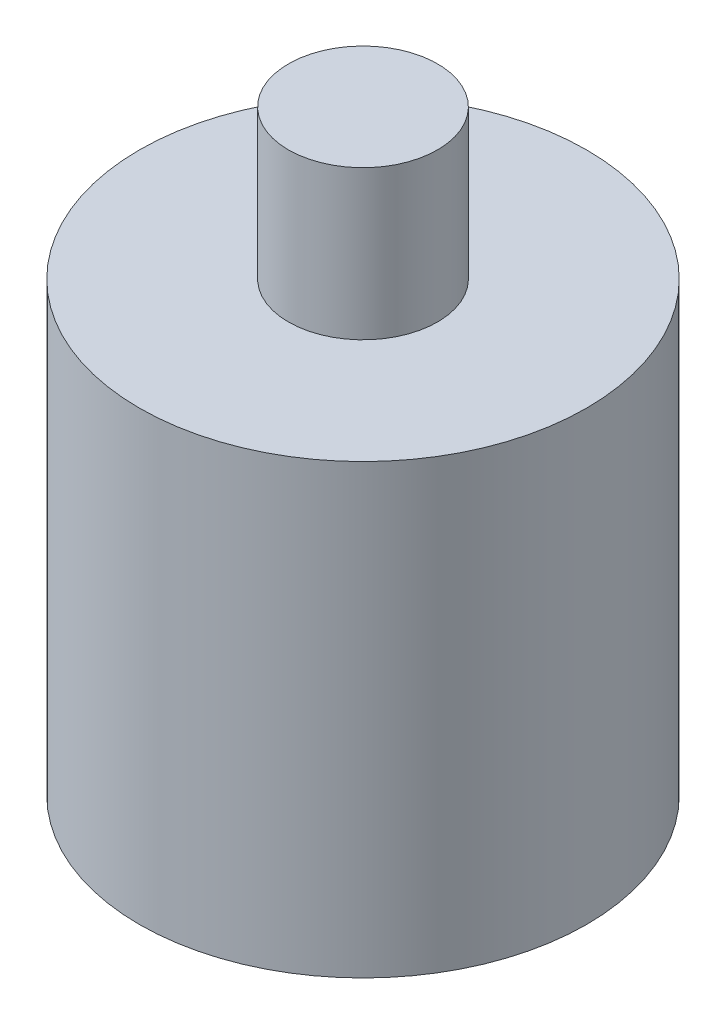
ISO-10303-21;
HEADER;
FILE_DESCRIPTION(('STEP AP214'),'2;1');
FILE_NAME('part.step','',(''),(''),'','','');
FILE_SCHEMA(('AUTOMOTIVE_DESIGN { 1 0 10303 214 1 1 1 1 }'));
ENDSEC;
DATA;
#1=APPLICATION_CONTEXT('core data for automotive mechanical design processes');
#2=APPLICATION_PROTOCOL_DEFINITION('international standard','automotive_design',2000,#1);
#3=PRODUCT_CONTEXT('',#1,'mechanical');
#4=PRODUCT('Part','Part','',(#3));
#5=PRODUCT_RELATED_PRODUCT_CATEGORY('part','',(#4));
#6=PRODUCT_DEFINITION_FORMATION('','',#4);
#7=PRODUCT_DEFINITION_CONTEXT('part definition',#1,'design');
#8=PRODUCT_DEFINITION('design','',#6,#7);
#9=PRODUCT_DEFINITION_SHAPE('','',#8);
#10=(LENGTH_UNIT() NAMED_UNIT(*) SI_UNIT(.MILLI.,.METRE.));
#11=(NAMED_UNIT(*) PLANE_ANGLE_UNIT() SI_UNIT($,.RADIAN.));
#12=(NAMED_UNIT(*) SI_UNIT($,.STERADIAN.) SOLID_ANGLE_UNIT());
#13=UNCERTAINTY_MEASURE_WITH_UNIT(LENGTH_MEASURE(1.E-05),#10,'distance_accuracy_value','');
#14=(GEOMETRIC_REPRESENTATION_CONTEXT(3) GLOBAL_UNCERTAINTY_ASSIGNED_CONTEXT((#13)) GLOBAL_UNIT_ASSIGNED_CONTEXT((#10,
#11,#12)) REPRESENTATION_CONTEXT('',''));
#15=CARTESIAN_POINT('',(0.,0.,0.));
#16=DIRECTION('',(0.,0.,1.));
#17=DIRECTION('',(1.,0.,0.));
#18=AXIS2_PLACEMENT_3D('',#15,#16,#17);
#19=CARTESIAN_POINT('',(0.,30.,0.));
#20=DIRECTION('',(0.,-1.,0.));
#21=DIRECTION('',(0.,0.,-1.));
#22=AXIS2_PLACEMENT_3D('',#19,#20,#21);
#23=CYLINDRICAL_SURFACE('',#22,15.);
#24=CARTESIAN_POINT('',(0.,30.,0.));
#25=DIRECTION('',(0.,1.,0.));
#26=DIRECTION('',(0.,0.,1.));
#27=AXIS2_PLACEMENT_3D('',#24,#25,#26);
#28=CIRCLE('',#27,15.);
#29=CARTESIAN_POINT('',(0.,30.,15.));
#30=VERTEX_POINT('',#29);
#31=EDGE_CURVE('E38',#30,#30,#28,.T.);
#32=ORIENTED_EDGE('',*,*,#31,.F.);
#33=EDGE_LOOP('',(#32));
#34=FACE_BOUND('',#33,.T.);
#35=CARTESIAN_POINT('',(0.,0.,0.));
#36=DIRECTION('',(0.,1.,0.));
#37=DIRECTION('',(0.,0.,1.));
#38=AXIS2_PLACEMENT_3D('',#35,#36,#37);
#39=CIRCLE('',#38,15.);
#40=CARTESIAN_POINT('',(0.,0.,15.));
#41=VERTEX_POINT('',#40);
#42=EDGE_CURVE('E34',#41,#41,#39,.T.);
#43=ORIENTED_EDGE('',*,*,#42,.T.);
#44=EDGE_LOOP('',(#43));
#45=FACE_BOUND('',#44,.T.);
#46=ADVANCED_FACE('F31',(#34,#45),#23,.T.);
#47=CARTESIAN_POINT('',(0.,30.,0.));
#48=DIRECTION('',(0.,1.,0.));
#49=DIRECTION('',(0.,0.,1.));
#50=AXIS2_PLACEMENT_3D('',#47,#48,#49);
#51=PLANE('',#50);
#52=CARTESIAN_POINT('',(0.,30.,0.));
#53=DIRECTION('',(0.,1.,0.));
#54=DIRECTION('',(0.,0.,1.));
#55=AXIS2_PLACEMENT_3D('',#52,#53,#54);
#56=CIRCLE('',#55,5.);
#57=CARTESIAN_POINT('',(0.,30.,5.));
#58=VERTEX_POINT('',#57);
#59=EDGE_CURVE('E10',#58,#58,#56,.T.);
#60=ORIENTED_EDGE('',*,*,#59,.F.);
#61=EDGE_LOOP('',(#60));
#62=FACE_BOUND('',#61,.T.);
#63=ORIENTED_EDGE('',*,*,#31,.T.);
#64=EDGE_LOOP('',(#63));
#65=FACE_BOUND('',#64,.T.);
#66=ADVANCED_FACE('F55',(#62,#65),#51,.T.);
#67=CARTESIAN_POINT('',(0.,0.,0.));
#68=DIRECTION('',(0.,1.,0.));
#69=DIRECTION('',(0.,0.,1.));
#70=AXIS2_PLACEMENT_3D('',#67,#68,#69);
#71=PLANE('',#70);
#72=ORIENTED_EDGE('',*,*,#42,.F.);
#73=EDGE_LOOP('',(#72));
#74=FACE_BOUND('',#73,.T.);
#75=ADVANCED_FACE('F52',(#74),#71,.F.);
#76=CARTESIAN_POINT('',(0.,40.,0.));
#77=DIRECTION('',(0.,-1.,0.));
#78=DIRECTION('',(0.,0.,-1.));
#79=AXIS2_PLACEMENT_3D('',#76,#77,#78);
#80=CYLINDRICAL_SURFACE('',#79,5.);
#81=CARTESIAN_POINT('',(0.,40.,0.));
#82=DIRECTION('',(0.,1.,0.));
#83=DIRECTION('',(0.,0.,1.));
#84=AXIS2_PLACEMENT_3D('',#81,#82,#83);
#85=CIRCLE('',#84,5.);
#86=CARTESIAN_POINT('',(0.,40.,5.));
#87=VERTEX_POINT('',#86);
#88=EDGE_CURVE('E44',#87,#87,#85,.T.);
#89=ORIENTED_EDGE('',*,*,#88,.F.);
#90=EDGE_LOOP('',(#89));
#91=FACE_BOUND('',#90,.T.);
#92=ORIENTED_EDGE('',*,*,#59,.T.);
#93=EDGE_LOOP('',(#92));
#94=FACE_BOUND('',#93,.T.);
#95=ADVANCED_FACE('F54',(#91,#94),#80,.T.);
#96=CARTESIAN_POINT('',(0.,40.,0.));
#97=DIRECTION('',(0.,1.,0.));
#98=DIRECTION('',(0.,0.,1.));
#99=AXIS2_PLACEMENT_3D('',#96,#97,#98);
#100=PLANE('',#99);
#101=ORIENTED_EDGE('',*,*,#88,.T.);
#102=EDGE_LOOP('',(#101));
#103=FACE_BOUND('',#102,.T.);
#104=ADVANCED_FACE('F60',(#103),#100,.T.);
#105=CLOSED_SHELL('',(#46,#66,#75,#95,#104));
#106=MANIFOLD_SOLID_BREP('B2',#105);
#107=ADVANCED_BREP_SHAPE_REPRESENTATION('',(#18,#106),#14);
#108=SHAPE_DEFINITION_REPRESENTATION(#9,#107);
ENDSEC;
END-ISO-10303-21;
